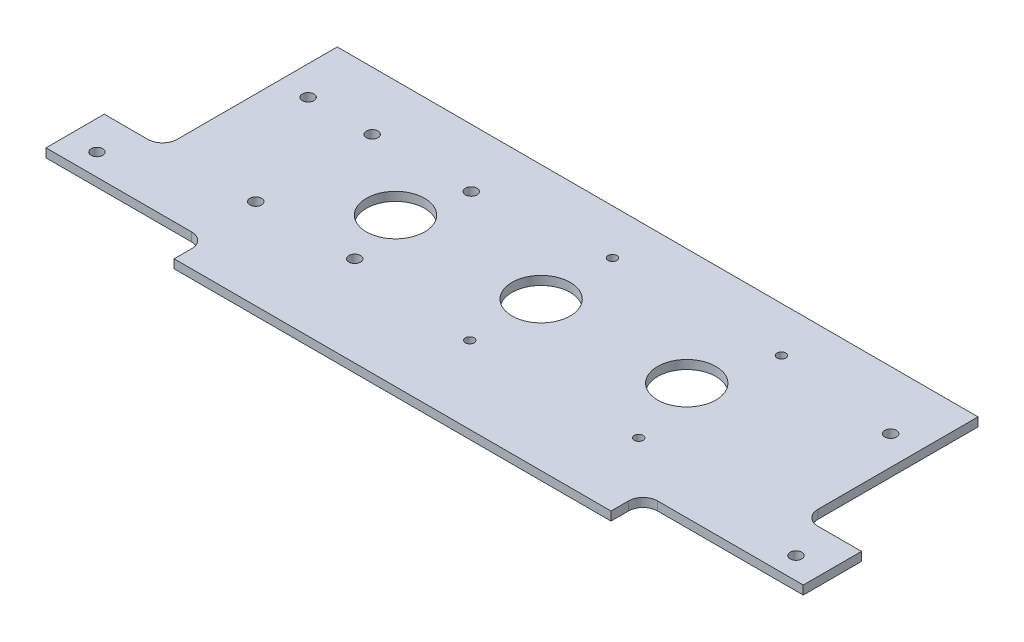
ISO-10303-21;
HEADER;
FILE_DESCRIPTION(('STEP AP214'),'2;1');
FILE_NAME('part.step','',(''),(''),'','','');
FILE_SCHEMA(('AUTOMOTIVE_DESIGN { 1 0 10303 214 1 1 1 1 }'));
ENDSEC;
DATA;
#1=APPLICATION_CONTEXT('core data for automotive mechanical design processes');
#2=APPLICATION_PROTOCOL_DEFINITION('international standard','automotive_design',2000,#1);
#3=PRODUCT_CONTEXT('',#1,'mechanical');
#4=PRODUCT('Part','Part','',(#3));
#5=PRODUCT_RELATED_PRODUCT_CATEGORY('part','',(#4));
#6=PRODUCT_DEFINITION_FORMATION('','',#4);
#7=PRODUCT_DEFINITION_CONTEXT('part definition',#1,'design');
#8=PRODUCT_DEFINITION('design','',#6,#7);
#9=PRODUCT_DEFINITION_SHAPE('','',#8);
#10=(LENGTH_UNIT() NAMED_UNIT(*) SI_UNIT(.MILLI.,.METRE.));
#11=(NAMED_UNIT(*) PLANE_ANGLE_UNIT() SI_UNIT($,.RADIAN.));
#12=(NAMED_UNIT(*) SI_UNIT($,.STERADIAN.) SOLID_ANGLE_UNIT());
#13=UNCERTAINTY_MEASURE_WITH_UNIT(LENGTH_MEASURE(1.E-05),#10,'distance_accuracy_value','');
#14=(GEOMETRIC_REPRESENTATION_CONTEXT(3) GLOBAL_UNCERTAINTY_ASSIGNED_CONTEXT((#13)) GLOBAL_UNIT_ASSIGNED_CONTEXT((#10,
#11,#12)) REPRESENTATION_CONTEXT('',''));
#15=CARTESIAN_POINT('',(0.,0.,0.));
#16=DIRECTION('',(0.,0.,1.));
#17=DIRECTION('',(1.,0.,0.));
#18=AXIS2_PLACEMENT_3D('',#15,#16,#17);
#19=CARTESIAN_POINT('',(110.,3.,40.));
#20=DIRECTION('',(0.,0.,-1.));
#21=DIRECTION('',(-1.,0.,0.));
#22=AXIS2_PLACEMENT_3D('',#19,#20,#21);
#23=PLANE('',#22);
#24=DIRECTION('',(1.,0.,0.));
#25=VECTOR('',#24,1.);
#26=CARTESIAN_POINT('',(110.,0.,40.));
#27=LINE('',#26,#25);
#28=CARTESIAN_POINT('',(-130.,0.,40.));
#29=VERTEX_POINT('',#28);
#30=CARTESIAN_POINT('',(-80.,0.,40.));
#31=VERTEX_POINT('',#30);
#32=EDGE_CURVE('E275',#29,#31,#27,.T.);
#33=ORIENTED_EDGE('',*,*,#32,.T.);
#34=DIRECTION('',(0.,1.,0.));
#35=VECTOR('',#34,1.);
#36=CARTESIAN_POINT('',(-80.,3.,40.));
#37=LINE('',#36,#35);
#38=CARTESIAN_POINT('',(-80.,3.,40.));
#39=VERTEX_POINT('',#38);
#40=EDGE_CURVE('E309',#31,#39,#37,.T.);
#41=ORIENTED_EDGE('',*,*,#40,.T.);
#42=DIRECTION('',(1.,0.,0.));
#43=VECTOR('',#42,1.);
#44=CARTESIAN_POINT('',(110.,3.,40.));
#45=LINE('',#44,#43);
#46=CARTESIAN_POINT('',(-130.,3.,40.));
#47=VERTEX_POINT('',#46);
#48=EDGE_CURVE('E265',#47,#39,#45,.T.);
#49=ORIENTED_EDGE('',*,*,#48,.F.);
#50=DIRECTION('',(0.,1.,0.));
#51=VECTOR('',#50,1.);
#52=CARTESIAN_POINT('',(-130.,0.,40.));
#53=LINE('',#52,#51);
#54=EDGE_CURVE('E254',#29,#47,#53,.T.);
#55=ORIENTED_EDGE('',*,*,#54,.F.);
#56=EDGE_LOOP('',(#33,#41,#49,#55));
#57=FACE_BOUND('',#56,.T.);
#58=ADVANCED_FACE('F35',(#57),#23,.F.);
#59=CARTESIAN_POINT('',(110.,3.,40.));
#60=DIRECTION('',(-1.,0.,0.));
#61=DIRECTION('',(0.,0.,1.));
#62=AXIS2_PLACEMENT_3D('',#59,#60,#61);
#63=PLANE('',#62);
#64=DIRECTION('',(0.,0.,-1.));
#65=VECTOR('',#64,1.);
#66=CARTESIAN_POINT('',(110.,3.,40.));
#67=LINE('',#66,#65);
#68=CARTESIAN_POINT('',(110.,3.,15.));
#69=VERTEX_POINT('',#68);
#70=CARTESIAN_POINT('',(110.,3.,-40.));
#71=VERTEX_POINT('',#70);
#72=EDGE_CURVE('E267',#69,#71,#67,.T.);
#73=ORIENTED_EDGE('',*,*,#72,.F.);
#74=DIRECTION('',(0.,1.,0.));
#75=VECTOR('',#74,1.);
#76=CARTESIAN_POINT('',(110.,0.,15.));
#77=LINE('',#76,#75);
#78=CARTESIAN_POINT('',(110.,0.,15.));
#79=VERTEX_POINT('',#78);
#80=EDGE_CURVE('E294',#69,#79,#77,.F.);
#81=ORIENTED_EDGE('',*,*,#80,.T.);
#82=DIRECTION('',(0.,0.,-1.));
#83=VECTOR('',#82,1.);
#84=CARTESIAN_POINT('',(110.,0.,40.));
#85=LINE('',#84,#83);
#86=CARTESIAN_POINT('',(110.,0.,-40.));
#87=VERTEX_POINT('',#86);
#88=EDGE_CURVE('E278',#79,#87,#85,.T.);
#89=ORIENTED_EDGE('',*,*,#88,.T.);
#90=DIRECTION('',(0.,-1.,0.));
#91=VECTOR('',#90,1.);
#92=CARTESIAN_POINT('',(110.,3.,-40.));
#93=LINE('',#92,#91);
#94=EDGE_CURVE('E283',#71,#87,#93,.T.);
#95=ORIENTED_EDGE('',*,*,#94,.F.);
#96=EDGE_LOOP('',(#73,#81,#89,#95));
#97=FACE_BOUND('',#96,.T.);
#98=ADVANCED_FACE('F387',(#97),#63,.F.);
#99=CARTESIAN_POINT('',(-110.,3.,40.));
#100=DIRECTION('',(1.,0.,0.));
#101=DIRECTION('',(0.,0.,-1.));
#102=AXIS2_PLACEMENT_3D('',#99,#100,#101);
#103=PLANE('',#102);
#104=DIRECTION('',(0.,0.,1.));
#105=VECTOR('',#104,1.);
#106=CARTESIAN_POINT('',(-110.,0.,40.));
#107=LINE('',#106,#105);
#108=CARTESIAN_POINT('',(-110.,0.,-40.));
#109=VERTEX_POINT('',#108);
#110=CARTESIAN_POINT('',(-110.,0.,15.));
#111=VERTEX_POINT('',#110);
#112=EDGE_CURVE('E257',#109,#111,#107,.T.);
#113=ORIENTED_EDGE('',*,*,#112,.T.);
#114=DIRECTION('',(0.,1.,0.));
#115=VECTOR('',#114,1.);
#116=CARTESIAN_POINT('',(-110.,3.,15.));
#117=LINE('',#116,#115);
#118=CARTESIAN_POINT('',(-110.,3.,15.));
#119=VERTEX_POINT('',#118);
#120=EDGE_CURVE('E286',#111,#119,#117,.T.);
#121=ORIENTED_EDGE('',*,*,#120,.T.);
#122=DIRECTION('',(0.,0.,1.));
#123=VECTOR('',#122,1.);
#124=CARTESIAN_POINT('',(-110.,3.,40.));
#125=LINE('',#124,#123);
#126=CARTESIAN_POINT('',(-110.,3.,-40.));
#127=VERTEX_POINT('',#126);
#128=EDGE_CURVE('E260',#127,#119,#125,.T.);
#129=ORIENTED_EDGE('',*,*,#128,.F.);
#130=DIRECTION('',(0.,-1.,0.));
#131=VECTOR('',#130,1.);
#132=CARTESIAN_POINT('',(-110.,3.,-40.));
#133=LINE('',#132,#131);
#134=EDGE_CURVE('E271',#127,#109,#133,.T.);
#135=ORIENTED_EDGE('',*,*,#134,.T.);
#136=EDGE_LOOP('',(#113,#121,#129,#135));
#137=FACE_BOUND('',#136,.T.);
#138=ADVANCED_FACE('F350',(#137),#103,.F.);
#139=CARTESIAN_POINT('',(80.,3.,40.));
#140=VERTEX_POINT('',#139);
#141=CARTESIAN_POINT('',(130.,3.,40.));
#142=VERTEX_POINT('',#141);
#143=EDGE_CURVE('E263',#140,#142,#45,.T.);
#144=ORIENTED_EDGE('',*,*,#143,.F.);
#145=DIRECTION('',(0.,-1.,0.));
#146=VECTOR('',#145,1.);
#147=CARTESIAN_POINT('',(80.,3.,40.));
#148=LINE('',#147,#146);
#149=CARTESIAN_POINT('',(80.,0.,40.));
#150=VERTEX_POINT('',#149);
#151=EDGE_CURVE('E304',#140,#150,#148,.T.);
#152=ORIENTED_EDGE('',*,*,#151,.T.);
#153=CARTESIAN_POINT('',(130.,0.,40.));
#154=VERTEX_POINT('',#153);
#155=EDGE_CURVE('E274',#150,#154,#27,.T.);
#156=ORIENTED_EDGE('',*,*,#155,.T.);
#157=DIRECTION('',(0.,1.,0.));
#158=VECTOR('',#157,1.);
#159=CARTESIAN_POINT('',(130.,0.,40.));
#160=LINE('',#159,#158);
#161=EDGE_CURVE('E228',#154,#142,#160,.T.);
#162=ORIENTED_EDGE('',*,*,#161,.T.);
#163=EDGE_LOOP('',(#144,#152,#156,#162));
#164=FACE_BOUND('',#163,.T.);
#165=ADVANCED_FACE('F326',(#164),#23,.F.);
#166=CARTESIAN_POINT('',(110.,3.,-40.));
#167=DIRECTION('',(0.,0.,1.));
#168=DIRECTION('',(1.,0.,0.));
#169=AXIS2_PLACEMENT_3D('',#166,#167,#168);
#170=PLANE('',#169);
#171=DIRECTION('',(-1.,0.,0.));
#172=VECTOR('',#171,1.);
#173=CARTESIAN_POINT('',(110.,0.,-40.));
#174=LINE('',#173,#172);
#175=EDGE_CURVE('E264',#87,#109,#174,.T.);
#176=ORIENTED_EDGE('',*,*,#175,.T.);
#177=ORIENTED_EDGE('',*,*,#134,.F.);
#178=DIRECTION('',(-1.,0.,0.));
#179=VECTOR('',#178,1.);
#180=CARTESIAN_POINT('',(110.,3.,-40.));
#181=LINE('',#180,#179);
#182=EDGE_CURVE('E269',#71,#127,#181,.T.);
#183=ORIENTED_EDGE('',*,*,#182,.F.);
#184=ORIENTED_EDGE('',*,*,#94,.T.);
#185=EDGE_LOOP('',(#176,#177,#183,#184));
#186=FACE_BOUND('',#185,.T.);
#187=ADVANCED_FACE('F357',(#186),#170,.F.);
#188=CARTESIAN_POINT('',(0.,3.,0.));
#189=DIRECTION('',(0.,1.,0.));
#190=DIRECTION('',(0.,0.,1.));
#191=AXIS2_PLACEMENT_3D('',#188,#189,#190);
#192=PLANE('',#191);
#193=CARTESIAN_POINT('',(-78.,3.,20.));
#194=DIRECTION('',(0.,1.,0.));
#195=DIRECTION('',(0.,0.,-1.));
#196=AXIS2_PLACEMENT_3D('',#193,#194,#195);
#197=CIRCLE('',#196,2.);
#198=CARTESIAN_POINT('',(-78.,3.,18.));
#199=VERTEX_POINT('',#198);
#200=EDGE_CURVE('E517',#199,#199,#197,.T.);
#201=ORIENTED_EDGE('',*,*,#200,.F.);
#202=EDGE_LOOP('',(#201));
#203=FACE_BOUND('',#202,.T.);
#204=CARTESIAN_POINT('',(-44.,3.,20.));
#205=DIRECTION('',(0.,1.,0.));
#206=DIRECTION('',(0.,0.,-1.));
#207=AXIS2_PLACEMENT_3D('',#204,#205,#206);
#208=CIRCLE('',#207,2.);
#209=CARTESIAN_POINT('',(-44.,3.,18.));
#210=VERTEX_POINT('',#209);
#211=EDGE_CURVE('E521',#210,#210,#208,.T.);
#212=ORIENTED_EDGE('',*,*,#211,.F.);
#213=EDGE_LOOP('',(#212));
#214=FACE_BOUND('',#213,.T.);
#215=CARTESIAN_POINT('',(-44.,3.,-20.));
#216=DIRECTION('',(0.,1.,0.));
#217=DIRECTION('',(0.,0.,1.));
#218=AXIS2_PLACEMENT_3D('',#215,#216,#217);
#219=CIRCLE('',#218,2.);
#220=CARTESIAN_POINT('',(-44.,3.,-18.));
#221=VERTEX_POINT('',#220);
#222=EDGE_CURVE('E525',#221,#221,#219,.T.);
#223=ORIENTED_EDGE('',*,*,#222,.F.);
#224=EDGE_LOOP('',(#223));
#225=FACE_BOUND('',#224,.T.);
#226=CARTESIAN_POINT('',(-78.,3.,-20.));
#227=DIRECTION('',(0.,1.,0.));
#228=DIRECTION('',(0.,0.,1.));
#229=AXIS2_PLACEMENT_3D('',#226,#227,#228);
#230=CIRCLE('',#229,2.);
#231=CARTESIAN_POINT('',(-78.,3.,-18.));
#232=VERTEX_POINT('',#231);
#233=EDGE_CURVE('E513',#232,#232,#230,.T.);
#234=ORIENTED_EDGE('',*,*,#233,.F.);
#235=EDGE_LOOP('',(#234));
#236=FACE_BOUND('',#235,.T.);
#237=CARTESIAN_POINT('',(-50.,3.,0.));
#238=DIRECTION('',(0.,1.,0.));
#239=DIRECTION('',(0.,0.,1.));
#240=AXIS2_PLACEMENT_3D('',#237,#238,#239);
#241=CIRCLE('',#240,10.);
#242=CARTESIAN_POINT('',(-50.,3.,10.));
#243=VERTEX_POINT('',#242);
#244=EDGE_CURVE('E509',#243,#243,#241,.T.);
#245=ORIENTED_EDGE('',*,*,#244,.F.);
#246=EDGE_LOOP('',(#245));
#247=FACE_BOUND('',#246,.T.);
#248=CARTESIAN_POINT('',(0.,3.,0.));
#249=DIRECTION('',(0.,1.,0.));
#250=DIRECTION('',(0.,0.,1.));
#251=AXIS2_PLACEMENT_3D('',#248,#249,#250);
#252=CIRCLE('',#251,10.);
#253=CARTESIAN_POINT('',(0.,3.,10.));
#254=VERTEX_POINT('',#253);
#255=EDGE_CURVE('E501',#254,#254,#252,.T.);
#256=ORIENTED_EDGE('',*,*,#255,.F.);
#257=EDGE_LOOP('',(#256));
#258=FACE_BOUND('',#257,.T.);
#259=CARTESIAN_POINT('',(50.,3.,0.));
#260=DIRECTION('',(0.,1.,0.));
#261=DIRECTION('',(0.,0.,1.));
#262=AXIS2_PLACEMENT_3D('',#259,#260,#261);
#263=CIRCLE('',#262,10.);
#264=CARTESIAN_POINT('',(50.,3.,10.));
#265=VERTEX_POINT('',#264);
#266=EDGE_CURVE('E502',#265,#265,#263,.T.);
#267=ORIENTED_EDGE('',*,*,#266,.F.);
#268=EDGE_LOOP('',(#267));
#269=FACE_BOUND('',#268,.T.);
#270=ORIENTED_EDGE('',*,*,#48,.T.);
#271=CARTESIAN_POINT('',(-80.,3.,45.));
#272=DIRECTION('',(0.,1.,0.));
#273=DIRECTION('',(0.,0.,1.));
#274=AXIS2_PLACEMENT_3D('',#271,#272,#273);
#275=CIRCLE('',#274,5.);
#276=CARTESIAN_POINT('',(-75.,3.,45.));
#277=VERTEX_POINT('',#276);
#278=EDGE_CURVE('E43',#39,#277,#275,.F.);
#279=ORIENTED_EDGE('',*,*,#278,.T.);
#280=DIRECTION('',(0.,0.,1.));
#281=VECTOR('',#280,1.);
#282=CARTESIAN_POINT('',(-75.,3.,51.));
#283=LINE('',#282,#281);
#284=CARTESIAN_POINT('',(-75.,3.,51.));
#285=VERTEX_POINT('',#284);
#286=EDGE_CURVE('E172',#277,#285,#283,.T.);
#287=ORIENTED_EDGE('',*,*,#286,.T.);
#288=DIRECTION('',(1.,0.,0.));
#289=VECTOR('',#288,1.);
#290=CARTESIAN_POINT('',(75.,3.,51.));
#291=LINE('',#290,#289);
#292=CARTESIAN_POINT('',(75.,3.,51.));
#293=VERTEX_POINT('',#292);
#294=EDGE_CURVE('E159',#285,#293,#291,.T.);
#295=ORIENTED_EDGE('',*,*,#294,.T.);
#296=DIRECTION('',(0.,0.,-1.));
#297=VECTOR('',#296,1.);
#298=CARTESIAN_POINT('',(75.,3.,51.));
#299=LINE('',#298,#297);
#300=CARTESIAN_POINT('',(75.,3.,45.));
#301=VERTEX_POINT('',#300);
#302=EDGE_CURVE('E153',#293,#301,#299,.T.);
#303=ORIENTED_EDGE('',*,*,#302,.T.);
#304=CARTESIAN_POINT('',(80.,3.,45.));
#305=DIRECTION('',(0.,1.,0.));
#306=DIRECTION('',(0.,0.,1.));
#307=AXIS2_PLACEMENT_3D('',#304,#305,#306);
#308=CIRCLE('',#307,5.);
#309=EDGE_CURVE('E315',#301,#140,#308,.F.);
#310=ORIENTED_EDGE('',*,*,#309,.T.);
#311=ORIENTED_EDGE('',*,*,#143,.T.);
#312=DIRECTION('',(0.,0.,1.));
#313=VECTOR('',#312,1.);
#314=CARTESIAN_POINT('',(130.,3.,40.));
#315=LINE('',#314,#313);
#316=CARTESIAN_POINT('',(130.,3.,20.));
#317=VERTEX_POINT('',#316);
#318=EDGE_CURVE('E219',#317,#142,#315,.T.);
#319=ORIENTED_EDGE('',*,*,#318,.F.);
#320=DIRECTION('',(1.,0.,0.));
#321=VECTOR('',#320,1.);
#322=CARTESIAN_POINT('',(110.,3.,20.));
#323=LINE('',#322,#321);
#324=CARTESIAN_POINT('',(115.,3.,20.));
#325=VERTEX_POINT('',#324);
#326=EDGE_CURVE('E226',#325,#317,#323,.T.);
#327=ORIENTED_EDGE('',*,*,#326,.F.);
#328=CARTESIAN_POINT('',(115.,3.,15.));
#329=DIRECTION('',(0.,1.,0.));
#330=DIRECTION('',(0.,0.,1.));
#331=AXIS2_PLACEMENT_3D('',#328,#329,#330);
#332=CIRCLE('',#331,5.);
#333=EDGE_CURVE('E300',#325,#69,#332,.F.);
#334=ORIENTED_EDGE('',*,*,#333,.T.);
#335=ORIENTED_EDGE('',*,*,#72,.T.);
#336=ORIENTED_EDGE('',*,*,#182,.T.);
#337=ORIENTED_EDGE('',*,*,#128,.T.);
#338=CARTESIAN_POINT('',(-115.,3.,15.));
#339=DIRECTION('',(0.,1.,0.));
#340=DIRECTION('',(0.,0.,1.));
#341=AXIS2_PLACEMENT_3D('',#338,#339,#340);
#342=CIRCLE('',#341,5.);
#343=CARTESIAN_POINT('',(-115.,3.,20.));
#344=VERTEX_POINT('',#343);
#345=EDGE_CURVE('E296',#119,#344,#342,.F.);
#346=ORIENTED_EDGE('',*,*,#345,.T.);
#347=DIRECTION('',(-1.,0.,0.));
#348=VECTOR('',#347,1.);
#349=CARTESIAN_POINT('',(-110.,3.,20.));
#350=LINE('',#349,#348);
#351=CARTESIAN_POINT('',(-130.,3.,20.));
#352=VERTEX_POINT('',#351);
#353=EDGE_CURVE('E241',#344,#352,#350,.T.);
#354=ORIENTED_EDGE('',*,*,#353,.T.);
#355=DIRECTION('',(0.,0.,1.));
#356=VECTOR('',#355,1.);
#357=CARTESIAN_POINT('',(-130.,3.,40.));
#358=LINE('',#357,#356);
#359=EDGE_CURVE('E247',#352,#47,#358,.T.);
#360=ORIENTED_EDGE('',*,*,#359,.T.);
#361=EDGE_LOOP('',(#270,#279,#287,#295,#303,#310,#311,#319,#327,#334,#335,#336,#337,#346,#354,#360));
#362=FACE_BOUND('',#361,.T.);
#363=CARTESIAN_POINT('',(0.,3.,24.5));
#364=DIRECTION('',(0.,1.,0.));
#365=DIRECTION('',(0.,0.,-1.));
#366=AXIS2_PLACEMENT_3D('',#363,#364,#365);
#367=CIRCLE('',#366,1.5);
#368=CARTESIAN_POINT('',(0.,3.,23.));
#369=VERTEX_POINT('',#368);
#370=EDGE_CURVE('E178',#369,#369,#367,.T.);
#371=ORIENTED_EDGE('',*,*,#370,.F.);
#372=EDGE_LOOP('',(#371));
#373=FACE_BOUND('',#372,.T.);
#374=CARTESIAN_POINT('',(58.,3.,24.5));
#375=DIRECTION('',(0.,1.,0.));
#376=DIRECTION('',(0.,0.,-1.));
#377=AXIS2_PLACEMENT_3D('',#374,#375,#376);
#378=CIRCLE('',#377,1.5);
#379=CARTESIAN_POINT('',(58.,3.,23.));
#380=VERTEX_POINT('',#379);
#381=EDGE_CURVE('E190',#380,#380,#378,.T.);
#382=ORIENTED_EDGE('',*,*,#381,.F.);
#383=EDGE_LOOP('',(#382));
#384=FACE_BOUND('',#383,.T.);
#385=CARTESIAN_POINT('',(58.,3.,-24.5));
#386=DIRECTION('',(0.,1.,0.));
#387=DIRECTION('',(0.,0.,1.));
#388=AXIS2_PLACEMENT_3D('',#385,#386,#387);
#389=CIRCLE('',#388,1.5);
#390=CARTESIAN_POINT('',(58.,3.,-23.));
#391=VERTEX_POINT('',#390);
#392=EDGE_CURVE('E184',#391,#391,#389,.T.);
#393=ORIENTED_EDGE('',*,*,#392,.F.);
#394=EDGE_LOOP('',(#393));
#395=FACE_BOUND('',#394,.T.);
#396=CARTESIAN_POINT('',(0.,3.,-24.5));
#397=DIRECTION('',(0.,1.,0.));
#398=DIRECTION('',(0.,0.,1.));
#399=AXIS2_PLACEMENT_3D('',#396,#397,#398);
#400=CIRCLE('',#399,1.5);
#401=CARTESIAN_POINT('',(0.,3.,-23.));
#402=VERTEX_POINT('',#401);
#403=EDGE_CURVE('E183',#402,#402,#400,.T.);
#404=ORIENTED_EDGE('',*,*,#403,.F.);
#405=EDGE_LOOP('',(#404));
#406=FACE_BOUND('',#405,.T.);
#407=CARTESIAN_POINT('',(-100.,3.,-20.));
#408=DIRECTION('',(0.,1.,0.));
#409=DIRECTION('',(0.,0.,1.));
#410=AXIS2_PLACEMENT_3D('',#407,#408,#409);
#411=CIRCLE('',#410,2.);
#412=CARTESIAN_POINT('',(-100.,3.,-18.));
#413=VERTEX_POINT('',#412);
#414=EDGE_CURVE('E208',#413,#413,#411,.T.);
#415=ORIENTED_EDGE('',*,*,#414,.F.);
#416=EDGE_LOOP('',(#415));
#417=FACE_BOUND('',#416,.T.);
#418=CARTESIAN_POINT('',(100.,3.,-20.));
#419=DIRECTION('',(0.,1.,0.));
#420=DIRECTION('',(0.,0.,-1.));
#421=AXIS2_PLACEMENT_3D('',#418,#419,#420);
#422=CIRCLE('',#421,2.);
#423=CARTESIAN_POINT('',(100.,3.,-22.));
#424=VERTEX_POINT('',#423);
#425=EDGE_CURVE('E201',#424,#424,#422,.T.);
#426=ORIENTED_EDGE('',*,*,#425,.F.);
#427=EDGE_LOOP('',(#426));
#428=FACE_BOUND('',#427,.T.);
#429=CARTESIAN_POINT('',(-120.,3.,32.5));
#430=DIRECTION('',(0.,1.,0.));
#431=DIRECTION('',(0.,0.,1.));
#432=AXIS2_PLACEMENT_3D('',#429,#430,#431);
#433=CIRCLE('',#432,2.);
#434=CARTESIAN_POINT('',(-120.,3.,34.5));
#435=VERTEX_POINT('',#434);
#436=EDGE_CURVE('E235',#435,#435,#433,.T.);
#437=ORIENTED_EDGE('',*,*,#436,.F.);
#438=EDGE_LOOP('',(#437));
#439=FACE_BOUND('',#438,.T.);
#440=CARTESIAN_POINT('',(120.,3.,32.5));
#441=DIRECTION('',(0.,-1.,0.));
#442=DIRECTION('',(0.,0.,1.));
#443=AXIS2_PLACEMENT_3D('',#440,#441,#442);
#444=CIRCLE('',#443,2.);
#445=CARTESIAN_POINT('',(120.,3.,34.5));
#446=VERTEX_POINT('',#445);
#447=EDGE_CURVE('E207',#446,#446,#444,.T.);
#448=ORIENTED_EDGE('',*,*,#447,.T.);
#449=EDGE_LOOP('',(#448));
#450=FACE_BOUND('',#449,.T.);
#451=ADVANCED_FACE('F318',(#203,#214,#225,#236,#247,#258,#269,#362,#373,#384,#395,#406,#417,
#428,#439,#450),#192,.T.);
#452=CARTESIAN_POINT('',(0.,0.,0.));
#453=DIRECTION('',(0.,1.,0.));
#454=DIRECTION('',(0.,0.,1.));
#455=AXIS2_PLACEMENT_3D('',#452,#453,#454);
#456=PLANE('',#455);
#457=CARTESIAN_POINT('',(-78.,0.,20.));
#458=DIRECTION('',(0.,1.,0.));
#459=DIRECTION('',(0.,0.,-1.));
#460=AXIS2_PLACEMENT_3D('',#457,#458,#459);
#461=CIRCLE('',#460,2.);
#462=CARTESIAN_POINT('',(-78.,0.,18.));
#463=VERTEX_POINT('',#462);
#464=EDGE_CURVE('E477',#463,#463,#461,.T.);
#465=ORIENTED_EDGE('',*,*,#464,.T.);
#466=EDGE_LOOP('',(#465));
#467=FACE_BOUND('',#466,.T.);
#468=CARTESIAN_POINT('',(-44.,0.,20.));
#469=DIRECTION('',(0.,1.,0.));
#470=DIRECTION('',(0.,0.,-1.));
#471=AXIS2_PLACEMENT_3D('',#468,#469,#470);
#472=CIRCLE('',#471,2.);
#473=CARTESIAN_POINT('',(-44.,0.,18.));
#474=VERTEX_POINT('',#473);
#475=EDGE_CURVE('E481',#474,#474,#472,.T.);
#476=ORIENTED_EDGE('',*,*,#475,.T.);
#477=EDGE_LOOP('',(#476));
#478=FACE_BOUND('',#477,.T.);
#479=CARTESIAN_POINT('',(-44.,0.,-20.));
#480=DIRECTION('',(0.,1.,0.));
#481=DIRECTION('',(0.,0.,1.));
#482=AXIS2_PLACEMENT_3D('',#479,#480,#481);
#483=CIRCLE('',#482,2.);
#484=CARTESIAN_POINT('',(-44.,0.,-18.));
#485=VERTEX_POINT('',#484);
#486=EDGE_CURVE('E485',#485,#485,#483,.T.);
#487=ORIENTED_EDGE('',*,*,#486,.T.);
#488=EDGE_LOOP('',(#487));
#489=FACE_BOUND('',#488,.T.);
#490=CARTESIAN_POINT('',(-78.,0.,-20.));
#491=DIRECTION('',(0.,1.,0.));
#492=DIRECTION('',(0.,0.,1.));
#493=AXIS2_PLACEMENT_3D('',#490,#491,#492);
#494=CIRCLE('',#493,2.);
#495=CARTESIAN_POINT('',(-78.,0.,-18.));
#496=VERTEX_POINT('',#495);
#497=EDGE_CURVE('E489',#496,#496,#494,.T.);
#498=ORIENTED_EDGE('',*,*,#497,.T.);
#499=EDGE_LOOP('',(#498));
#500=FACE_BOUND('',#499,.T.);
#501=CARTESIAN_POINT('',(-50.,0.,0.));
#502=DIRECTION('',(0.,1.,0.));
#503=DIRECTION('',(0.,0.,1.));
#504=AXIS2_PLACEMENT_3D('',#501,#502,#503);
#505=CIRCLE('',#504,10.);
#506=CARTESIAN_POINT('',(-50.,0.,10.));
#507=VERTEX_POINT('',#506);
#508=EDGE_CURVE('E174',#507,#507,#505,.T.);
#509=ORIENTED_EDGE('',*,*,#508,.T.);
#510=EDGE_LOOP('',(#509));
#511=FACE_BOUND('',#510,.T.);
#512=CARTESIAN_POINT('',(0.,0.,0.));
#513=DIRECTION('',(0.,1.,0.));
#514=DIRECTION('',(0.,0.,1.));
#515=AXIS2_PLACEMENT_3D('',#512,#513,#514);
#516=CIRCLE('',#515,10.);
#517=CARTESIAN_POINT('',(0.,0.,10.));
#518=VERTEX_POINT('',#517);
#519=EDGE_CURVE('E496',#518,#518,#516,.T.);
#520=ORIENTED_EDGE('',*,*,#519,.T.);
#521=EDGE_LOOP('',(#520));
#522=FACE_BOUND('',#521,.T.);
#523=CARTESIAN_POINT('',(50.,0.,0.));
#524=DIRECTION('',(0.,1.,0.));
#525=DIRECTION('',(0.,0.,1.));
#526=AXIS2_PLACEMENT_3D('',#523,#524,#525);
#527=CIRCLE('',#526,10.);
#528=CARTESIAN_POINT('',(50.,0.,10.));
#529=VERTEX_POINT('',#528);
#530=EDGE_CURVE('E499',#529,#529,#527,.T.);
#531=ORIENTED_EDGE('',*,*,#530,.T.);
#532=EDGE_LOOP('',(#531));
#533=FACE_BOUND('',#532,.T.);
#534=ORIENTED_EDGE('',*,*,#155,.F.);
#535=CARTESIAN_POINT('',(80.,0.,45.));
#536=DIRECTION('',(0.,1.,0.));
#537=DIRECTION('',(0.,0.,1.));
#538=AXIS2_PLACEMENT_3D('',#535,#536,#537);
#539=CIRCLE('',#538,5.);
#540=CARTESIAN_POINT('',(75.,0.,45.));
#541=VERTEX_POINT('',#540);
#542=EDGE_CURVE('E313',#150,#541,#539,.T.);
#543=ORIENTED_EDGE('',*,*,#542,.T.);
#544=DIRECTION('',(0.,0.,-1.));
#545=VECTOR('',#544,1.);
#546=CARTESIAN_POINT('',(75.,0.,51.));
#547=LINE('',#546,#545);
#548=CARTESIAN_POINT('',(75.,0.,51.));
#549=VERTEX_POINT('',#548);
#550=EDGE_CURVE('E161',#549,#541,#547,.T.);
#551=ORIENTED_EDGE('',*,*,#550,.F.);
#552=DIRECTION('',(1.,0.,0.));
#553=VECTOR('',#552,1.);
#554=CARTESIAN_POINT('',(75.,0.,51.));
#555=LINE('',#554,#553);
#556=CARTESIAN_POINT('',(-75.,0.,51.));
#557=VERTEX_POINT('',#556);
#558=EDGE_CURVE('E152',#557,#549,#555,.T.);
#559=ORIENTED_EDGE('',*,*,#558,.F.);
#560=DIRECTION('',(0.,0.,1.));
#561=VECTOR('',#560,1.);
#562=CARTESIAN_POINT('',(-75.,0.,51.));
#563=LINE('',#562,#561);
#564=CARTESIAN_POINT('',(-75.,0.,45.));
#565=VERTEX_POINT('',#564);
#566=EDGE_CURVE('E144',#565,#557,#563,.T.);
#567=ORIENTED_EDGE('',*,*,#566,.F.);
#568=CARTESIAN_POINT('',(-80.,0.,45.));
#569=DIRECTION('',(0.,1.,0.));
#570=DIRECTION('',(0.,0.,1.));
#571=AXIS2_PLACEMENT_3D('',#568,#569,#570);
#572=CIRCLE('',#571,5.);
#573=EDGE_CURVE('E11',#565,#31,#572,.T.);
#574=ORIENTED_EDGE('',*,*,#573,.T.);
#575=ORIENTED_EDGE('',*,*,#32,.F.);
#576=DIRECTION('',(0.,0.,1.));
#577=VECTOR('',#576,1.);
#578=CARTESIAN_POINT('',(-130.,0.,40.));
#579=LINE('',#578,#577);
#580=CARTESIAN_POINT('',(-130.,0.,20.));
#581=VERTEX_POINT('',#580);
#582=EDGE_CURVE('E246',#581,#29,#579,.T.);
#583=ORIENTED_EDGE('',*,*,#582,.F.);
#584=DIRECTION('',(-1.,0.,0.));
#585=VECTOR('',#584,1.);
#586=CARTESIAN_POINT('',(-110.,0.,20.));
#587=LINE('',#586,#585);
#588=CARTESIAN_POINT('',(-115.,0.,20.));
#589=VERTEX_POINT('',#588);
#590=EDGE_CURVE('E244',#589,#581,#587,.T.);
#591=ORIENTED_EDGE('',*,*,#590,.F.);
#592=CARTESIAN_POINT('',(-115.,0.,15.));
#593=DIRECTION('',(0.,1.,0.));
#594=DIRECTION('',(0.,0.,1.));
#595=AXIS2_PLACEMENT_3D('',#592,#593,#594);
#596=CIRCLE('',#595,5.);
#597=EDGE_CURVE('E298',#589,#111,#596,.T.);
#598=ORIENTED_EDGE('',*,*,#597,.T.);
#599=ORIENTED_EDGE('',*,*,#112,.F.);
#600=ORIENTED_EDGE('',*,*,#175,.F.);
#601=ORIENTED_EDGE('',*,*,#88,.F.);
#602=CARTESIAN_POINT('',(115.,0.,15.));
#603=DIRECTION('',(0.,1.,0.));
#604=DIRECTION('',(0.,0.,1.));
#605=AXIS2_PLACEMENT_3D('',#602,#603,#604);
#606=CIRCLE('',#605,5.);
#607=CARTESIAN_POINT('',(115.,0.,20.));
#608=VERTEX_POINT('',#607);
#609=EDGE_CURVE('E302',#79,#608,#606,.T.);
#610=ORIENTED_EDGE('',*,*,#609,.T.);
#611=DIRECTION('',(1.,0.,0.));
#612=VECTOR('',#611,1.);
#613=CARTESIAN_POINT('',(110.,0.,20.));
#614=LINE('',#613,#612);
#615=CARTESIAN_POINT('',(130.,0.,20.));
#616=VERTEX_POINT('',#615);
#617=EDGE_CURVE('E225',#608,#616,#614,.T.);
#618=ORIENTED_EDGE('',*,*,#617,.T.);
#619=DIRECTION('',(0.,0.,1.));
#620=VECTOR('',#619,1.);
#621=CARTESIAN_POINT('',(130.,0.,40.));
#622=LINE('',#621,#620);
#623=EDGE_CURVE('E222',#616,#154,#622,.T.);
#624=ORIENTED_EDGE('',*,*,#623,.T.);
#625=EDGE_LOOP('',(#534,#543,#551,#559,#567,#574,#575,#583,#591,#598,#599,#600,#601,#610,#618,#624));
#626=FACE_BOUND('',#625,.T.);
#627=CARTESIAN_POINT('',(0.,0.,24.5));
#628=DIRECTION('',(0.,1.,0.));
#629=DIRECTION('',(0.,0.,-1.));
#630=AXIS2_PLACEMENT_3D('',#627,#628,#629);
#631=CIRCLE('',#630,1.5);
#632=CARTESIAN_POINT('',(0.,0.,23.));
#633=VERTEX_POINT('',#632);
#634=EDGE_CURVE('E193',#633,#633,#631,.T.);
#635=ORIENTED_EDGE('',*,*,#634,.T.);
#636=EDGE_LOOP('',(#635));
#637=FACE_BOUND('',#636,.T.);
#638=CARTESIAN_POINT('',(58.,0.,24.5));
#639=DIRECTION('',(0.,1.,0.));
#640=DIRECTION('',(0.,0.,-1.));
#641=AXIS2_PLACEMENT_3D('',#638,#639,#640);
#642=CIRCLE('',#641,1.5);
#643=CARTESIAN_POINT('',(58.,0.,23.));
#644=VERTEX_POINT('',#643);
#645=EDGE_CURVE('E187',#644,#644,#642,.T.);
#646=ORIENTED_EDGE('',*,*,#645,.T.);
#647=EDGE_LOOP('',(#646));
#648=FACE_BOUND('',#647,.T.);
#649=CARTESIAN_POINT('',(58.,0.,-24.5));
#650=DIRECTION('',(0.,1.,0.));
#651=DIRECTION('',(0.,0.,1.));
#652=AXIS2_PLACEMENT_3D('',#649,#650,#651);
#653=CIRCLE('',#652,1.5);
#654=CARTESIAN_POINT('',(58.,0.,-23.));
#655=VERTEX_POINT('',#654);
#656=EDGE_CURVE('E180',#655,#655,#653,.T.);
#657=ORIENTED_EDGE('',*,*,#656,.T.);
#658=EDGE_LOOP('',(#657));
#659=FACE_BOUND('',#658,.T.);
#660=CARTESIAN_POINT('',(0.,0.,-24.5));
#661=DIRECTION('',(0.,1.,0.));
#662=DIRECTION('',(0.,0.,1.));
#663=AXIS2_PLACEMENT_3D('',#660,#661,#662);
#664=CIRCLE('',#663,1.5);
#665=CARTESIAN_POINT('',(0.,0.,-23.));
#666=VERTEX_POINT('',#665);
#667=EDGE_CURVE('E198',#666,#666,#664,.T.);
#668=ORIENTED_EDGE('',*,*,#667,.T.);
#669=EDGE_LOOP('',(#668));
#670=FACE_BOUND('',#669,.T.);
#671=CARTESIAN_POINT('',(-100.,0.,-20.));
#672=DIRECTION('',(0.,1.,0.));
#673=DIRECTION('',(0.,0.,1.));
#674=AXIS2_PLACEMENT_3D('',#671,#672,#673);
#675=CIRCLE('',#674,2.);
#676=CARTESIAN_POINT('',(-100.,0.,-18.));
#677=VERTEX_POINT('',#676);
#678=EDGE_CURVE('E204',#677,#677,#675,.T.);
#679=ORIENTED_EDGE('',*,*,#678,.T.);
#680=EDGE_LOOP('',(#679));
#681=FACE_BOUND('',#680,.T.);
#682=CARTESIAN_POINT('',(100.,0.,-20.));
#683=DIRECTION('',(0.,1.,0.));
#684=DIRECTION('',(0.,0.,-1.));
#685=AXIS2_PLACEMENT_3D('',#682,#683,#684);
#686=CIRCLE('',#685,2.);
#687=CARTESIAN_POINT('',(100.,0.,-22.));
#688=VERTEX_POINT('',#687);
#689=EDGE_CURVE('E211',#688,#688,#686,.T.);
#690=ORIENTED_EDGE('',*,*,#689,.T.);
#691=EDGE_LOOP('',(#690));
#692=FACE_BOUND('',#691,.T.);
#693=CARTESIAN_POINT('',(-120.,0.,32.5));
#694=DIRECTION('',(0.,1.,0.));
#695=DIRECTION('',(0.,0.,1.));
#696=AXIS2_PLACEMENT_3D('',#693,#694,#695);
#697=CIRCLE('',#696,2.);
#698=CARTESIAN_POINT('',(-120.,0.,34.5));
#699=VERTEX_POINT('',#698);
#700=EDGE_CURVE('E238',#699,#699,#697,.T.);
#701=ORIENTED_EDGE('',*,*,#700,.T.);
#702=EDGE_LOOP('',(#701));
#703=FACE_BOUND('',#702,.T.);
#704=CARTESIAN_POINT('',(120.,0.,32.5));
#705=DIRECTION('',(0.,-1.,0.));
#706=DIRECTION('',(0.,0.,1.));
#707=AXIS2_PLACEMENT_3D('',#704,#705,#706);
#708=CIRCLE('',#707,2.);
#709=CARTESIAN_POINT('',(120.,0.,34.5));
#710=VERTEX_POINT('',#709);
#711=EDGE_CURVE('E216',#710,#710,#708,.T.);
#712=ORIENTED_EDGE('',*,*,#711,.F.);
#713=EDGE_LOOP('',(#712));
#714=FACE_BOUND('',#713,.T.);
#715=ADVANCED_FACE('F165',(#467,#478,#489,#500,#511,#522,#533,#626,#637,#648,#659,#670,#681,
#692,#703,#714),#456,.F.);
#716=CARTESIAN_POINT('',(-130.,0.,40.));
#717=DIRECTION('',(-1.,0.,0.));
#718=DIRECTION('',(0.,0.,1.));
#719=AXIS2_PLACEMENT_3D('',#716,#717,#718);
#720=PLANE('',#719);
#721=ORIENTED_EDGE('',*,*,#359,.F.);
#722=DIRECTION('',(0.,1.,0.));
#723=VECTOR('',#722,1.);
#724=CARTESIAN_POINT('',(-130.,0.,20.));
#725=LINE('',#724,#723);
#726=EDGE_CURVE('E250',#581,#352,#725,.T.);
#727=ORIENTED_EDGE('',*,*,#726,.F.);
#728=ORIENTED_EDGE('',*,*,#582,.T.);
#729=ORIENTED_EDGE('',*,*,#54,.T.);
#730=EDGE_LOOP('',(#721,#727,#728,#729));
#731=FACE_BOUND('',#730,.T.);
#732=ADVANCED_FACE('F339',(#731),#720,.T.);
#733=CARTESIAN_POINT('',(-110.,0.,20.));
#734=DIRECTION('',(0.,0.,-1.));
#735=DIRECTION('',(-1.,0.,0.));
#736=AXIS2_PLACEMENT_3D('',#733,#734,#735);
#737=PLANE('',#736);
#738=ORIENTED_EDGE('',*,*,#353,.F.);
#739=DIRECTION('',(0.,1.,0.));
#740=VECTOR('',#739,1.);
#741=CARTESIAN_POINT('',(-115.,0.,20.));
#742=LINE('',#741,#740);
#743=EDGE_CURVE('E289',#344,#589,#742,.F.);
#744=ORIENTED_EDGE('',*,*,#743,.T.);
#745=ORIENTED_EDGE('',*,*,#590,.T.);
#746=ORIENTED_EDGE('',*,*,#726,.T.);
#747=EDGE_LOOP('',(#738,#744,#745,#746));
#748=FACE_BOUND('',#747,.T.);
#749=ADVANCED_FACE('F460',(#748),#737,.T.);
#750=CARTESIAN_POINT('',(-120.,0.,32.5));
#751=DIRECTION('',(0.,1.,0.));
#752=DIRECTION('',(0.,0.,1.));
#753=AXIS2_PLACEMENT_3D('',#750,#751,#752);
#754=CYLINDRICAL_SURFACE('',#753,2.);
#755=ORIENTED_EDGE('',*,*,#700,.F.);
#756=EDGE_LOOP('',(#755));
#757=FACE_BOUND('',#756,.T.);
#758=ORIENTED_EDGE('',*,*,#436,.T.);
#759=EDGE_LOOP('',(#758));
#760=FACE_BOUND('',#759,.T.);
#761=ADVANCED_FACE('F383',(#757,#760),#754,.F.);
#762=CARTESIAN_POINT('',(110.,0.,20.));
#763=DIRECTION('',(0.,0.,1.));
#764=DIRECTION('',(1.,0.,0.));
#765=AXIS2_PLACEMENT_3D('',#762,#763,#764);
#766=PLANE('',#765);
#767=ORIENTED_EDGE('',*,*,#617,.F.);
#768=DIRECTION('',(0.,1.,0.));
#769=VECTOR('',#768,1.);
#770=CARTESIAN_POINT('',(115.,3.,20.));
#771=LINE('',#770,#769);
#772=EDGE_CURVE('E291',#608,#325,#771,.T.);
#773=ORIENTED_EDGE('',*,*,#772,.T.);
#774=ORIENTED_EDGE('',*,*,#326,.T.);
#775=DIRECTION('',(0.,1.,0.));
#776=VECTOR('',#775,1.);
#777=CARTESIAN_POINT('',(130.,0.,20.));
#778=LINE('',#777,#776);
#779=EDGE_CURVE('E232',#616,#317,#778,.T.);
#780=ORIENTED_EDGE('',*,*,#779,.F.);
#781=EDGE_LOOP('',(#767,#773,#774,#780));
#782=FACE_BOUND('',#781,.T.);
#783=ADVANCED_FACE('F369',(#782),#766,.F.);
#784=CARTESIAN_POINT('',(130.,0.,40.));
#785=DIRECTION('',(-1.,0.,0.));
#786=DIRECTION('',(0.,0.,1.));
#787=AXIS2_PLACEMENT_3D('',#784,#785,#786);
#788=PLANE('',#787);
#789=ORIENTED_EDGE('',*,*,#318,.T.);
#790=ORIENTED_EDGE('',*,*,#161,.F.);
#791=ORIENTED_EDGE('',*,*,#623,.F.);
#792=ORIENTED_EDGE('',*,*,#779,.T.);
#793=EDGE_LOOP('',(#789,#790,#791,#792));
#794=FACE_BOUND('',#793,.T.);
#795=ADVANCED_FACE('F372',(#794),#788,.F.);
#796=CARTESIAN_POINT('',(120.,0.,32.5));
#797=DIRECTION('',(0.,1.,0.));
#798=DIRECTION('',(0.,0.,1.));
#799=AXIS2_PLACEMENT_3D('',#796,#797,#798);
#800=CYLINDRICAL_SURFACE('',#799,2.);
#801=ORIENTED_EDGE('',*,*,#711,.T.);
#802=EDGE_LOOP('',(#801));
#803=FACE_BOUND('',#802,.T.);
#804=ORIENTED_EDGE('',*,*,#447,.F.);
#805=EDGE_LOOP('',(#804));
#806=FACE_BOUND('',#805,.T.);
#807=ADVANCED_FACE('F375',(#803,#806),#800,.F.);
#808=CARTESIAN_POINT('',(-115.,3.,15.));
#809=DIRECTION('',(0.,1.,0.));
#810=DIRECTION('',(0.,0.,1.));
#811=AXIS2_PLACEMENT_3D('',#808,#809,#810);
#812=CYLINDRICAL_SURFACE('',#811,5.);
#813=ORIENTED_EDGE('',*,*,#597,.F.);
#814=ORIENTED_EDGE('',*,*,#743,.F.);
#815=ORIENTED_EDGE('',*,*,#345,.F.);
#816=ORIENTED_EDGE('',*,*,#120,.F.);
#817=EDGE_LOOP('',(#813,#814,#815,#816));
#818=FACE_BOUND('',#817,.T.);
#819=ADVANCED_FACE('F347',(#818),#812,.F.);
#820=CARTESIAN_POINT('',(115.,0.,15.));
#821=DIRECTION('',(0.,-1.,0.));
#822=DIRECTION('',(0.,0.,-1.));
#823=AXIS2_PLACEMENT_3D('',#820,#821,#822);
#824=CYLINDRICAL_SURFACE('',#823,5.);
#825=ORIENTED_EDGE('',*,*,#609,.F.);
#826=ORIENTED_EDGE('',*,*,#80,.F.);
#827=ORIENTED_EDGE('',*,*,#333,.F.);
#828=ORIENTED_EDGE('',*,*,#772,.F.);
#829=EDGE_LOOP('',(#825,#826,#827,#828));
#830=FACE_BOUND('',#829,.T.);
#831=ADVANCED_FACE('F366',(#830),#824,.F.);
#832=CARTESIAN_POINT('',(100.,0.,-20.));
#833=DIRECTION('',(0.,1.,0.));
#834=DIRECTION('',(0.,0.,1.));
#835=AXIS2_PLACEMENT_3D('',#832,#833,#834);
#836=CYLINDRICAL_SURFACE('',#835,2.);
#837=ORIENTED_EDGE('',*,*,#689,.F.);
#838=EDGE_LOOP('',(#837));
#839=FACE_BOUND('',#838,.T.);
#840=ORIENTED_EDGE('',*,*,#425,.T.);
#841=EDGE_LOOP('',(#840));
#842=FACE_BOUND('',#841,.T.);
#843=ADVANCED_FACE('F406',(#839,#842),#836,.F.);
#844=CARTESIAN_POINT('',(-100.,0.,-20.));
#845=DIRECTION('',(0.,1.,0.));
#846=DIRECTION('',(0.,0.,1.));
#847=AXIS2_PLACEMENT_3D('',#844,#845,#846);
#848=CYLINDRICAL_SURFACE('',#847,2.);
#849=ORIENTED_EDGE('',*,*,#678,.F.);
#850=EDGE_LOOP('',(#849));
#851=FACE_BOUND('',#850,.T.);
#852=ORIENTED_EDGE('',*,*,#414,.T.);
#853=EDGE_LOOP('',(#852));
#854=FACE_BOUND('',#853,.T.);
#855=ADVANCED_FACE('F437',(#851,#854),#848,.F.);
#856=CARTESIAN_POINT('',(0.,0.,-24.5));
#857=DIRECTION('',(0.,1.,0.));
#858=DIRECTION('',(0.,0.,1.));
#859=AXIS2_PLACEMENT_3D('',#856,#857,#858);
#860=CYLINDRICAL_SURFACE('',#859,1.5);
#861=ORIENTED_EDGE('',*,*,#667,.F.);
#862=EDGE_LOOP('',(#861));
#863=FACE_BOUND('',#862,.T.);
#864=ORIENTED_EDGE('',*,*,#403,.T.);
#865=EDGE_LOOP('',(#864));
#866=FACE_BOUND('',#865,.T.);
#867=ADVANCED_FACE('F427',(#863,#866),#860,.F.);
#868=CARTESIAN_POINT('',(58.,0.,-24.5));
#869=DIRECTION('',(0.,1.,0.));
#870=DIRECTION('',(0.,0.,1.));
#871=AXIS2_PLACEMENT_3D('',#868,#869,#870);
#872=CYLINDRICAL_SURFACE('',#871,1.5);
#873=ORIENTED_EDGE('',*,*,#656,.F.);
#874=EDGE_LOOP('',(#873));
#875=FACE_BOUND('',#874,.T.);
#876=ORIENTED_EDGE('',*,*,#392,.T.);
#877=EDGE_LOOP('',(#876));
#878=FACE_BOUND('',#877,.T.);
#879=ADVANCED_FACE('F423',(#875,#878),#872,.F.);
#880=CARTESIAN_POINT('',(58.,0.,24.5));
#881=DIRECTION('',(0.,1.,0.));
#882=DIRECTION('',(0.,0.,1.));
#883=AXIS2_PLACEMENT_3D('',#880,#881,#882);
#884=CYLINDRICAL_SURFACE('',#883,1.5);
#885=ORIENTED_EDGE('',*,*,#645,.F.);
#886=EDGE_LOOP('',(#885));
#887=FACE_BOUND('',#886,.T.);
#888=ORIENTED_EDGE('',*,*,#381,.T.);
#889=EDGE_LOOP('',(#888));
#890=FACE_BOUND('',#889,.T.);
#891=ADVANCED_FACE('F426',(#887,#890),#884,.F.);
#892=CARTESIAN_POINT('',(0.,0.,24.5));
#893=DIRECTION('',(0.,1.,0.));
#894=DIRECTION('',(0.,0.,1.));
#895=AXIS2_PLACEMENT_3D('',#892,#893,#894);
#896=CYLINDRICAL_SURFACE('',#895,1.5);
#897=ORIENTED_EDGE('',*,*,#634,.F.);
#898=EDGE_LOOP('',(#897));
#899=FACE_BOUND('',#898,.T.);
#900=ORIENTED_EDGE('',*,*,#370,.T.);
#901=EDGE_LOOP('',(#900));
#902=FACE_BOUND('',#901,.T.);
#903=ADVANCED_FACE('F422',(#899,#902),#896,.F.);
#904=CARTESIAN_POINT('',(-75.,0.,51.));
#905=DIRECTION('',(-1.,0.,0.));
#906=DIRECTION('',(0.,0.,1.));
#907=AXIS2_PLACEMENT_3D('',#904,#905,#906);
#908=PLANE('',#907);
#909=ORIENTED_EDGE('',*,*,#286,.F.);
#910=DIRECTION('',(0.,1.,0.));
#911=VECTOR('',#910,1.);
#912=CARTESIAN_POINT('',(-75.,0.,45.));
#913=LINE('',#912,#911);
#914=EDGE_CURVE('E56',#277,#565,#913,.F.);
#915=ORIENTED_EDGE('',*,*,#914,.T.);
#916=ORIENTED_EDGE('',*,*,#566,.T.);
#917=DIRECTION('',(0.,1.,0.));
#918=VECTOR('',#917,1.);
#919=CARTESIAN_POINT('',(-75.,0.,51.));
#920=LINE('',#919,#918);
#921=EDGE_CURVE('E147',#557,#285,#920,.T.);
#922=ORIENTED_EDGE('',*,*,#921,.T.);
#923=EDGE_LOOP('',(#909,#915,#916,#922));
#924=FACE_BOUND('',#923,.T.);
#925=ADVANCED_FACE('F146',(#924),#908,.T.);
#926=CARTESIAN_POINT('',(75.,0.,51.));
#927=DIRECTION('',(1.,0.,0.));
#928=DIRECTION('',(0.,0.,-1.));
#929=AXIS2_PLACEMENT_3D('',#926,#927,#928);
#930=PLANE('',#929);
#931=ORIENTED_EDGE('',*,*,#550,.T.);
#932=DIRECTION('',(0.,-1.,0.));
#933=VECTOR('',#932,1.);
#934=CARTESIAN_POINT('',(75.,0.,45.));
#935=LINE('',#934,#933);
#936=EDGE_CURVE('E307',#541,#301,#935,.F.);
#937=ORIENTED_EDGE('',*,*,#936,.T.);
#938=ORIENTED_EDGE('',*,*,#302,.F.);
#939=DIRECTION('',(0.,1.,0.));
#940=VECTOR('',#939,1.);
#941=CARTESIAN_POINT('',(75.,0.,51.));
#942=LINE('',#941,#940);
#943=EDGE_CURVE('E160',#549,#293,#942,.T.);
#944=ORIENTED_EDGE('',*,*,#943,.F.);
#945=EDGE_LOOP('',(#931,#937,#938,#944));
#946=FACE_BOUND('',#945,.T.);
#947=ADVANCED_FACE('F330',(#946),#930,.T.);
#948=CARTESIAN_POINT('',(75.,0.,51.));
#949=DIRECTION('',(0.,0.,1.));
#950=DIRECTION('',(1.,0.,0.));
#951=AXIS2_PLACEMENT_3D('',#948,#949,#950);
#952=PLANE('',#951);
#953=ORIENTED_EDGE('',*,*,#294,.F.);
#954=ORIENTED_EDGE('',*,*,#921,.F.);
#955=ORIENTED_EDGE('',*,*,#558,.T.);
#956=ORIENTED_EDGE('',*,*,#943,.T.);
#957=EDGE_LOOP('',(#953,#954,#955,#956));
#958=FACE_BOUND('',#957,.T.);
#959=ADVANCED_FACE('F157',(#958),#952,.T.);
#960=CARTESIAN_POINT('',(80.,3.,45.));
#961=DIRECTION('',(0.,-1.,0.));
#962=DIRECTION('',(0.,0.,-1.));
#963=AXIS2_PLACEMENT_3D('',#960,#961,#962);
#964=CYLINDRICAL_SURFACE('',#963,5.);
#965=ORIENTED_EDGE('',*,*,#309,.F.);
#966=ORIENTED_EDGE('',*,*,#936,.F.);
#967=ORIENTED_EDGE('',*,*,#542,.F.);
#968=ORIENTED_EDGE('',*,*,#151,.F.);
#969=EDGE_LOOP('',(#965,#966,#967,#968));
#970=FACE_BOUND('',#969,.T.);
#971=ADVANCED_FACE('F328',(#970),#964,.F.);
#972=CARTESIAN_POINT('',(-80.,3.,45.));
#973=DIRECTION('',(0.,1.,0.));
#974=DIRECTION('',(0.,0.,1.));
#975=AXIS2_PLACEMENT_3D('',#972,#973,#974);
#976=CYLINDRICAL_SURFACE('',#975,5.);
#977=ORIENTED_EDGE('',*,*,#573,.F.);
#978=ORIENTED_EDGE('',*,*,#914,.F.);
#979=ORIENTED_EDGE('',*,*,#278,.F.);
#980=ORIENTED_EDGE('',*,*,#40,.F.);
#981=EDGE_LOOP('',(#977,#978,#979,#980));
#982=FACE_BOUND('',#981,.T.);
#983=ADVANCED_FACE('F37',(#982),#976,.F.);
#984=CARTESIAN_POINT('',(50.,0.,0.));
#985=DIRECTION('',(0.,1.,0.));
#986=DIRECTION('',(0.,0.,1.));
#987=AXIS2_PLACEMENT_3D('',#984,#985,#986);
#988=CYLINDRICAL_SURFACE('',#987,10.);
#989=ORIENTED_EDGE('',*,*,#530,.F.);
#990=EDGE_LOOP('',(#989));
#991=FACE_BOUND('',#990,.T.);
#992=ORIENTED_EDGE('',*,*,#266,.T.);
#993=EDGE_LOOP('',(#992));
#994=FACE_BOUND('',#993,.T.);
#995=ADVANCED_FACE('F412',(#991,#994),#988,.F.);
#996=CARTESIAN_POINT('',(0.,0.,0.));
#997=DIRECTION('',(0.,1.,0.));
#998=DIRECTION('',(0.,0.,1.));
#999=AXIS2_PLACEMENT_3D('',#996,#997,#998);
#1000=CYLINDRICAL_SURFACE('',#999,10.);
#1001=ORIENTED_EDGE('',*,*,#519,.F.);
#1002=EDGE_LOOP('',(#1001));
#1003=FACE_BOUND('',#1002,.T.);
#1004=ORIENTED_EDGE('',*,*,#255,.T.);
#1005=EDGE_LOOP('',(#1004));
#1006=FACE_BOUND('',#1005,.T.);
#1007=ADVANCED_FACE('F542',(#1003,#1006),#1000,.F.);
#1008=CARTESIAN_POINT('',(-50.,0.,0.));
#1009=DIRECTION('',(0.,1.,0.));
#1010=DIRECTION('',(0.,0.,1.));
#1011=AXIS2_PLACEMENT_3D('',#1008,#1009,#1010);
#1012=CYLINDRICAL_SURFACE('',#1011,10.);
#1013=ORIENTED_EDGE('',*,*,#508,.F.);
#1014=EDGE_LOOP('',(#1013));
#1015=FACE_BOUND('',#1014,.T.);
#1016=ORIENTED_EDGE('',*,*,#244,.T.);
#1017=EDGE_LOOP('',(#1016));
#1018=FACE_BOUND('',#1017,.T.);
#1019=ADVANCED_FACE('F546',(#1015,#1018),#1012,.F.);
#1020=CARTESIAN_POINT('',(-78.,0.,-20.));
#1021=DIRECTION('',(0.,1.,0.));
#1022=DIRECTION('',(0.,0.,1.));
#1023=AXIS2_PLACEMENT_3D('',#1020,#1021,#1022);
#1024=CYLINDRICAL_SURFACE('',#1023,2.);
#1025=ORIENTED_EDGE('',*,*,#497,.F.);
#1026=EDGE_LOOP('',(#1025));
#1027=FACE_BOUND('',#1026,.T.);
#1028=ORIENTED_EDGE('',*,*,#233,.T.);
#1029=EDGE_LOOP('',(#1028));
#1030=FACE_BOUND('',#1029,.T.);
#1031=ADVANCED_FACE('F552',(#1027,#1030),#1024,.F.);
#1032=CARTESIAN_POINT('',(-44.,0.,-20.));
#1033=DIRECTION('',(0.,1.,0.));
#1034=DIRECTION('',(0.,0.,1.));
#1035=AXIS2_PLACEMENT_3D('',#1032,#1033,#1034);
#1036=CYLINDRICAL_SURFACE('',#1035,2.);
#1037=ORIENTED_EDGE('',*,*,#486,.F.);
#1038=EDGE_LOOP('',(#1037));
#1039=FACE_BOUND('',#1038,.T.);
#1040=ORIENTED_EDGE('',*,*,#222,.T.);
#1041=EDGE_LOOP('',(#1040));
#1042=FACE_BOUND('',#1041,.T.);
#1043=ADVANCED_FACE('F530',(#1039,#1042),#1036,.F.);
#1044=CARTESIAN_POINT('',(-44.,0.,20.));
#1045=DIRECTION('',(0.,1.,0.));
#1046=DIRECTION('',(0.,0.,1.));
#1047=AXIS2_PLACEMENT_3D('',#1044,#1045,#1046);
#1048=CYLINDRICAL_SURFACE('',#1047,2.);
#1049=ORIENTED_EDGE('',*,*,#475,.F.);
#1050=EDGE_LOOP('',(#1049));
#1051=FACE_BOUND('',#1050,.T.);
#1052=ORIENTED_EDGE('',*,*,#211,.T.);
#1053=EDGE_LOOP('',(#1052));
#1054=FACE_BOUND('',#1053,.T.);
#1055=ADVANCED_FACE('F560',(#1051,#1054),#1048,.F.);
#1056=CARTESIAN_POINT('',(-78.,0.,20.));
#1057=DIRECTION('',(0.,1.,0.));
#1058=DIRECTION('',(0.,0.,1.));
#1059=AXIS2_PLACEMENT_3D('',#1056,#1057,#1058);
#1060=CYLINDRICAL_SURFACE('',#1059,2.);
#1061=ORIENTED_EDGE('',*,*,#464,.F.);
#1062=EDGE_LOOP('',(#1061));
#1063=FACE_BOUND('',#1062,.T.);
#1064=ORIENTED_EDGE('',*,*,#200,.T.);
#1065=EDGE_LOOP('',(#1064));
#1066=FACE_BOUND('',#1065,.T.);
#1067=ADVANCED_FACE('F557',(#1063,#1066),#1060,.F.);
#1068=CLOSED_SHELL('',(#58,#98,#138,#165,#187,#451,#715,#732,#749,#761,#783,#795,#807,#819,#831,
#843,#855,#867,#879,#891,#903,#925,#947,#959,#971,#983,#995,#1007,#1019,#1031,#1043,#1055,#1067));
#1069=MANIFOLD_SOLID_BREP('B2',#1068);
#1070=ADVANCED_BREP_SHAPE_REPRESENTATION('',(#18,#1069),#14);
#1071=SHAPE_DEFINITION_REPRESENTATION(#9,#1070);
ENDSEC;
END-ISO-10303-21;
